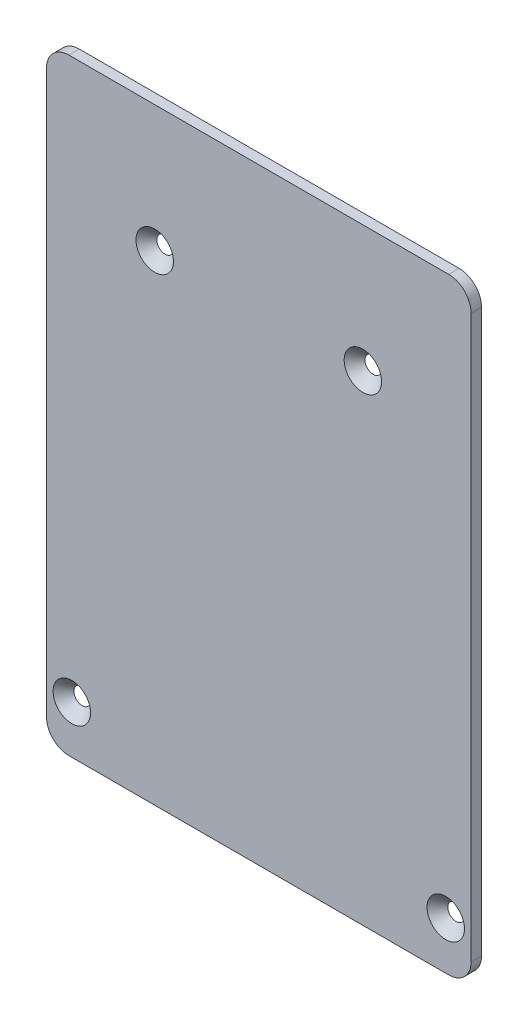
ISO-10303-21;
HEADER;
FILE_DESCRIPTION(('STEP AP214'),'2;1');
FILE_NAME('part.step','',(''),(''),'','','');
FILE_SCHEMA(('AUTOMOTIVE_DESIGN { 1 0 10303 214 1 1 1 1 }'));
ENDSEC;
DATA;
#1=APPLICATION_CONTEXT('core data for automotive mechanical design processes');
#2=APPLICATION_PROTOCOL_DEFINITION('international standard','automotive_design',2000,#1);
#3=PRODUCT_CONTEXT('',#1,'mechanical');
#4=PRODUCT('Part','Part','',(#3));
#5=PRODUCT_RELATED_PRODUCT_CATEGORY('part','',(#4));
#6=PRODUCT_DEFINITION_FORMATION('','',#4);
#7=PRODUCT_DEFINITION_CONTEXT('part definition',#1,'design');
#8=PRODUCT_DEFINITION('design','',#6,#7);
#9=PRODUCT_DEFINITION_SHAPE('','',#8);
#10=(LENGTH_UNIT() NAMED_UNIT(*) SI_UNIT(.MILLI.,.METRE.));
#11=(NAMED_UNIT(*) PLANE_ANGLE_UNIT() SI_UNIT($,.RADIAN.));
#12=(NAMED_UNIT(*) SI_UNIT($,.STERADIAN.) SOLID_ANGLE_UNIT());
#13=UNCERTAINTY_MEASURE_WITH_UNIT(LENGTH_MEASURE(1.E-05),#10,'distance_accuracy_value','');
#14=(GEOMETRIC_REPRESENTATION_CONTEXT(3) GLOBAL_UNCERTAINTY_ASSIGNED_CONTEXT((#13)) GLOBAL_UNIT_ASSIGNED_CONTEXT((#10,
#11,#12)) REPRESENTATION_CONTEXT('',''));
#15=CARTESIAN_POINT('',(0.,0.,0.));
#16=DIRECTION('',(0.,0.,1.));
#17=DIRECTION('',(1.,0.,0.));
#18=AXIS2_PLACEMENT_3D('',#15,#16,#17);
#19=CARTESIAN_POINT('',(-36.5,-54.,-2.));
#20=DIRECTION('',(0.,0.,1.));
#21=DIRECTION('',(1.,0.,0.));
#22=AXIS2_PLACEMENT_3D('',#19,#20,#21);
#23=CYLINDRICAL_SURFACE('',#22,4.3);
#24=CARTESIAN_POINT('',(-36.5,-54.,0.));
#25=DIRECTION('',(0.,0.,1.));
#26=DIRECTION('',(1.,0.,0.));
#27=AXIS2_PLACEMENT_3D('',#24,#25,#26);
#28=CIRCLE('',#27,4.3);
#29=CARTESIAN_POINT('',(-40.8,-54.,0.));
#30=VERTEX_POINT('',#29);
#31=CARTESIAN_POINT('',(-36.5,-58.3,0.));
#32=VERTEX_POINT('',#31);
#33=EDGE_CURVE('E260',#30,#32,#28,.T.);
#34=ORIENTED_EDGE('',*,*,#33,.F.);
#35=DIRECTION('',(0.,0.,1.));
#36=VECTOR('',#35,1.);
#37=CARTESIAN_POINT('',(-40.8,-54.,-2.));
#38=LINE('',#37,#36);
#39=CARTESIAN_POINT('',(-40.8,-54.,-2.));
#40=VERTEX_POINT('',#39);
#41=EDGE_CURVE('E172',#40,#30,#38,.T.);
#42=ORIENTED_EDGE('',*,*,#41,.F.);
#43=CARTESIAN_POINT('',(-36.5,-54.,-2.));
#44=DIRECTION('',(0.,0.,1.));
#45=DIRECTION('',(1.,0.,0.));
#46=AXIS2_PLACEMENT_3D('',#43,#44,#45);
#47=CIRCLE('',#46,4.3);
#48=CARTESIAN_POINT('',(-36.5,-58.3,-2.));
#49=VERTEX_POINT('',#48);
#50=EDGE_CURVE('E290',#40,#49,#47,.T.);
#51=ORIENTED_EDGE('',*,*,#50,.T.);
#52=DIRECTION('',(0.,0.,1.));
#53=VECTOR('',#52,1.);
#54=CARTESIAN_POINT('',(-36.5,-58.3,-2.));
#55=LINE('',#54,#53);
#56=EDGE_CURVE('E213',#49,#32,#55,.T.);
#57=ORIENTED_EDGE('',*,*,#56,.T.);
#58=EDGE_LOOP('',(#34,#42,#51,#57));
#59=FACE_BOUND('',#58,.T.);
#60=ADVANCED_FACE('F153',(#59),#23,.T.);
#61=CARTESIAN_POINT('',(-40.8,54.,-2.));
#62=DIRECTION('',(-1.,0.,0.));
#63=DIRECTION('',(0.,0.,1.));
#64=AXIS2_PLACEMENT_3D('',#61,#62,#63);
#65=PLANE('',#64);
#66=DIRECTION('',(0.,-1.,0.));
#67=VECTOR('',#66,1.);
#68=CARTESIAN_POINT('',(-40.8,54.,0.));
#69=LINE('',#68,#67);
#70=CARTESIAN_POINT('',(-40.8,54.,0.));
#71=VERTEX_POINT('',#70);
#72=EDGE_CURVE('E286',#71,#30,#69,.T.);
#73=ORIENTED_EDGE('',*,*,#72,.F.);
#74=DIRECTION('',(0.,0.,1.));
#75=VECTOR('',#74,1.);
#76=CARTESIAN_POINT('',(-40.8,54.,-2.));
#77=LINE('',#76,#75);
#78=CARTESIAN_POINT('',(-40.8,54.,-2.));
#79=VERTEX_POINT('',#78);
#80=EDGE_CURVE('E201',#79,#71,#77,.T.);
#81=ORIENTED_EDGE('',*,*,#80,.F.);
#82=DIRECTION('',(0.,-1.,0.));
#83=VECTOR('',#82,1.);
#84=CARTESIAN_POINT('',(-40.8,54.,-2.));
#85=LINE('',#84,#83);
#86=EDGE_CURVE('E246',#79,#40,#85,.T.);
#87=ORIENTED_EDGE('',*,*,#86,.T.);
#88=ORIENTED_EDGE('',*,*,#41,.T.);
#89=EDGE_LOOP('',(#73,#81,#87,#88));
#90=FACE_BOUND('',#89,.T.);
#91=ADVANCED_FACE('F361',(#90),#65,.T.);
#92=CARTESIAN_POINT('',(-36.5,54.,-2.));
#93=DIRECTION('',(0.,0.,1.));
#94=DIRECTION('',(1.,0.,0.));
#95=AXIS2_PLACEMENT_3D('',#92,#93,#94);
#96=CYLINDRICAL_SURFACE('',#95,4.29999999999999);
#97=CARTESIAN_POINT('',(-36.5,54.,0.));
#98=DIRECTION('',(0.,0.,1.));
#99=DIRECTION('',(1.,0.,0.));
#100=AXIS2_PLACEMENT_3D('',#97,#98,#99);
#101=CIRCLE('',#100,4.29999999999999);
#102=CARTESIAN_POINT('',(-36.5,58.3,0.));
#103=VERTEX_POINT('',#102);
#104=EDGE_CURVE('E232',#103,#71,#101,.T.);
#105=ORIENTED_EDGE('',*,*,#104,.F.);
#106=DIRECTION('',(0.,0.,1.));
#107=VECTOR('',#106,1.);
#108=CARTESIAN_POINT('',(-36.5,58.3,-2.));
#109=LINE('',#108,#107);
#110=CARTESIAN_POINT('',(-36.5,58.3,-2.));
#111=VERTEX_POINT('',#110);
#112=EDGE_CURVE('E227',#111,#103,#109,.T.);
#113=ORIENTED_EDGE('',*,*,#112,.F.);
#114=CARTESIAN_POINT('',(-36.5,54.,-2.));
#115=DIRECTION('',(0.,0.,1.));
#116=DIRECTION('',(1.,0.,0.));
#117=AXIS2_PLACEMENT_3D('',#114,#115,#116);
#118=CIRCLE('',#117,4.29999999999999);
#119=EDGE_CURVE('E230',#111,#79,#118,.T.);
#120=ORIENTED_EDGE('',*,*,#119,.T.);
#121=ORIENTED_EDGE('',*,*,#80,.T.);
#122=EDGE_LOOP('',(#105,#113,#120,#121));
#123=FACE_BOUND('',#122,.T.);
#124=ADVANCED_FACE('F229',(#123),#96,.T.);
#125=CARTESIAN_POINT('',(36.5,58.3,-2.));
#126=DIRECTION('',(0.,1.,0.));
#127=DIRECTION('',(0.,0.,1.));
#128=AXIS2_PLACEMENT_3D('',#125,#126,#127);
#129=PLANE('',#128);
#130=DIRECTION('',(-1.,0.,0.));
#131=VECTOR('',#130,1.);
#132=CARTESIAN_POINT('',(36.5,58.3,0.));
#133=LINE('',#132,#131);
#134=CARTESIAN_POINT('',(36.5,58.3,0.));
#135=VERTEX_POINT('',#134);
#136=EDGE_CURVE('E281',#135,#103,#133,.T.);
#137=ORIENTED_EDGE('',*,*,#136,.F.);
#138=DIRECTION('',(0.,0.,1.));
#139=VECTOR('',#138,1.);
#140=CARTESIAN_POINT('',(36.5,58.3,-2.));
#141=LINE('',#140,#139);
#142=CARTESIAN_POINT('',(36.5,58.3,-2.));
#143=VERTEX_POINT('',#142);
#144=EDGE_CURVE('E238',#143,#135,#141,.T.);
#145=ORIENTED_EDGE('',*,*,#144,.F.);
#146=DIRECTION('',(-1.,0.,0.));
#147=VECTOR('',#146,1.);
#148=CARTESIAN_POINT('',(36.5,58.3,-2.));
#149=LINE('',#148,#147);
#150=EDGE_CURVE('E244',#143,#111,#149,.T.);
#151=ORIENTED_EDGE('',*,*,#150,.T.);
#152=ORIENTED_EDGE('',*,*,#112,.T.);
#153=EDGE_LOOP('',(#137,#145,#151,#152));
#154=FACE_BOUND('',#153,.T.);
#155=ADVANCED_FACE('F249',(#154),#129,.T.);
#156=CARTESIAN_POINT('',(36.5,54.,-2.));
#157=DIRECTION('',(0.,0.,1.));
#158=DIRECTION('',(1.,0.,0.));
#159=AXIS2_PLACEMENT_3D('',#156,#157,#158);
#160=CYLINDRICAL_SURFACE('',#159,4.3);
#161=CARTESIAN_POINT('',(36.5,54.,0.));
#162=DIRECTION('',(0.,0.,1.));
#163=DIRECTION('',(1.,0.,0.));
#164=AXIS2_PLACEMENT_3D('',#161,#162,#163);
#165=CIRCLE('',#164,4.3);
#166=CARTESIAN_POINT('',(40.8,54.,0.));
#167=VERTEX_POINT('',#166);
#168=EDGE_CURVE('E277',#167,#135,#165,.T.);
#169=ORIENTED_EDGE('',*,*,#168,.F.);
#170=DIRECTION('',(0.,0.,1.));
#171=VECTOR('',#170,1.);
#172=CARTESIAN_POINT('',(40.8,54.,-2.));
#173=LINE('',#172,#171);
#174=CARTESIAN_POINT('',(40.8,54.,-2.));
#175=VERTEX_POINT('',#174);
#176=EDGE_CURVE('E298',#175,#167,#173,.T.);
#177=ORIENTED_EDGE('',*,*,#176,.F.);
#178=CARTESIAN_POINT('',(36.5,54.,-2.));
#179=DIRECTION('',(0.,0.,1.));
#180=DIRECTION('',(1.,0.,0.));
#181=AXIS2_PLACEMENT_3D('',#178,#179,#180);
#182=CIRCLE('',#181,4.3);
#183=EDGE_CURVE('E251',#175,#143,#182,.T.);
#184=ORIENTED_EDGE('',*,*,#183,.T.);
#185=ORIENTED_EDGE('',*,*,#144,.T.);
#186=EDGE_LOOP('',(#169,#177,#184,#185));
#187=FACE_BOUND('',#186,.T.);
#188=ADVANCED_FACE('F375',(#187),#160,.T.);
#189=CARTESIAN_POINT('',(40.8,-54.,-2.));
#190=DIRECTION('',(1.,0.,0.));
#191=DIRECTION('',(0.,0.,-1.));
#192=AXIS2_PLACEMENT_3D('',#189,#190,#191);
#193=PLANE('',#192);
#194=DIRECTION('',(0.,1.,0.));
#195=VECTOR('',#194,1.);
#196=CARTESIAN_POINT('',(40.8,-54.,0.));
#197=LINE('',#196,#195);
#198=CARTESIAN_POINT('',(40.8,-54.,0.));
#199=VERTEX_POINT('',#198);
#200=EDGE_CURVE('E273',#199,#167,#197,.T.);
#201=ORIENTED_EDGE('',*,*,#200,.F.);
#202=DIRECTION('',(0.,0.,1.));
#203=VECTOR('',#202,1.);
#204=CARTESIAN_POINT('',(40.8,-54.,-2.));
#205=LINE('',#204,#203);
#206=CARTESIAN_POINT('',(40.8,-54.,-2.));
#207=VERTEX_POINT('',#206);
#208=EDGE_CURVE('E301',#207,#199,#205,.T.);
#209=ORIENTED_EDGE('',*,*,#208,.F.);
#210=DIRECTION('',(0.,1.,0.));
#211=VECTOR('',#210,1.);
#212=CARTESIAN_POINT('',(40.8,-54.,-2.));
#213=LINE('',#212,#211);
#214=EDGE_CURVE('E254',#207,#175,#213,.T.);
#215=ORIENTED_EDGE('',*,*,#214,.T.);
#216=ORIENTED_EDGE('',*,*,#176,.T.);
#217=EDGE_LOOP('',(#201,#209,#215,#216));
#218=FACE_BOUND('',#217,.T.);
#219=ADVANCED_FACE('F353',(#218),#193,.T.);
#220=CARTESIAN_POINT('',(36.5,-54.,-2.));
#221=DIRECTION('',(0.,0.,1.));
#222=DIRECTION('',(1.,0.,0.));
#223=AXIS2_PLACEMENT_3D('',#220,#221,#222);
#224=CYLINDRICAL_SURFACE('',#223,4.3);
#225=CARTESIAN_POINT('',(36.5,-54.,0.));
#226=DIRECTION('',(0.,0.,1.));
#227=DIRECTION('',(1.,0.,0.));
#228=AXIS2_PLACEMENT_3D('',#225,#226,#227);
#229=CIRCLE('',#228,4.3);
#230=CARTESIAN_POINT('',(36.5,-58.3,0.));
#231=VERTEX_POINT('',#230);
#232=EDGE_CURVE('E269',#231,#199,#229,.T.);
#233=ORIENTED_EDGE('',*,*,#232,.F.);
#234=DIRECTION('',(0.,0.,1.));
#235=VECTOR('',#234,1.);
#236=CARTESIAN_POINT('',(36.5,-58.3,-2.));
#237=LINE('',#236,#235);
#238=CARTESIAN_POINT('',(36.5,-58.3,-2.));
#239=VERTEX_POINT('',#238);
#240=EDGE_CURVE('E304',#239,#231,#237,.T.);
#241=ORIENTED_EDGE('',*,*,#240,.F.);
#242=CARTESIAN_POINT('',(36.5,-54.,-2.));
#243=DIRECTION('',(0.,0.,1.));
#244=DIRECTION('',(1.,0.,0.));
#245=AXIS2_PLACEMENT_3D('',#242,#243,#244);
#246=CIRCLE('',#245,4.3);
#247=EDGE_CURVE('E345',#239,#207,#246,.T.);
#248=ORIENTED_EDGE('',*,*,#247,.T.);
#249=ORIENTED_EDGE('',*,*,#208,.T.);
#250=EDGE_LOOP('',(#233,#241,#248,#249));
#251=FACE_BOUND('',#250,.T.);
#252=ADVANCED_FACE('F358',(#251),#224,.T.);
#253=CARTESIAN_POINT('',(-36.5,-58.3,-2.));
#254=DIRECTION('',(0.,-1.,0.));
#255=DIRECTION('',(0.,0.,-1.));
#256=AXIS2_PLACEMENT_3D('',#253,#254,#255);
#257=PLANE('',#256);
#258=DIRECTION('',(1.,0.,0.));
#259=VECTOR('',#258,1.);
#260=CARTESIAN_POINT('',(-36.5,-58.3,0.));
#261=LINE('',#260,#259);
#262=EDGE_CURVE('E264',#32,#231,#261,.T.);
#263=ORIENTED_EDGE('',*,*,#262,.F.);
#264=ORIENTED_EDGE('',*,*,#56,.F.);
#265=DIRECTION('',(1.,0.,0.));
#266=VECTOR('',#265,1.);
#267=CARTESIAN_POINT('',(-36.5,-58.3,-2.));
#268=LINE('',#267,#266);
#269=EDGE_CURVE('E342',#49,#239,#268,.T.);
#270=ORIENTED_EDGE('',*,*,#269,.T.);
#271=ORIENTED_EDGE('',*,*,#240,.T.);
#272=EDGE_LOOP('',(#263,#264,#270,#271));
#273=FACE_BOUND('',#272,.T.);
#274=ADVANCED_FACE('F359',(#273),#257,.T.);
#275=CARTESIAN_POINT('',(-36.5,-54.,-2.));
#276=DIRECTION('',(0.,0.,1.));
#277=DIRECTION('',(1.,0.,0.));
#278=AXIS2_PLACEMENT_3D('',#275,#276,#277);
#279=PLANE('',#278);
#280=CARTESIAN_POINT('',(20.,34.,-2.));
#281=DIRECTION('',(0.,0.,1.));
#282=DIRECTION('',(1.,0.,0.));
#283=AXIS2_PLACEMENT_3D('',#280,#281,#282);
#284=CIRCLE('',#283,1.6);
#285=CARTESIAN_POINT('',(21.6,34.,-2.));
#286=VERTEX_POINT('',#285);
#287=EDGE_CURVE('E408',#286,#286,#284,.T.);
#288=ORIENTED_EDGE('',*,*,#287,.T.);
#289=EDGE_LOOP('',(#288));
#290=FACE_BOUND('',#289,.T.);
#291=CARTESIAN_POINT('',(-20.,34.,-2.));
#292=DIRECTION('',(0.,0.,1.));
#293=DIRECTION('',(1.,0.,0.));
#294=AXIS2_PLACEMENT_3D('',#291,#292,#293);
#295=CIRCLE('',#294,1.6);
#296=CARTESIAN_POINT('',(-18.4,34.,-2.));
#297=VERTEX_POINT('',#296);
#298=EDGE_CURVE('E336',#297,#297,#295,.T.);
#299=ORIENTED_EDGE('',*,*,#298,.T.);
#300=EDGE_LOOP('',(#299));
#301=FACE_BOUND('',#300,.T.);
#302=CARTESIAN_POINT('',(-35.93,-49.1,-2.));
#303=DIRECTION('',(0.,0.,1.));
#304=DIRECTION('',(1.,0.,0.));
#305=AXIS2_PLACEMENT_3D('',#302,#303,#304);
#306=CIRCLE('',#305,1.6);
#307=CARTESIAN_POINT('',(-34.33,-49.1,-2.));
#308=VERTEX_POINT('',#307);
#309=EDGE_CURVE('E332',#308,#308,#306,.T.);
#310=ORIENTED_EDGE('',*,*,#309,.T.);
#311=EDGE_LOOP('',(#310));
#312=FACE_BOUND('',#311,.T.);
#313=CARTESIAN_POINT('',(35.93,-49.1,-2.));
#314=DIRECTION('',(0.,0.,1.));
#315=DIRECTION('',(1.,0.,0.));
#316=AXIS2_PLACEMENT_3D('',#313,#314,#315);
#317=CIRCLE('',#316,1.6);
#318=CARTESIAN_POINT('',(37.53,-49.1,-2.));
#319=VERTEX_POINT('',#318);
#320=EDGE_CURVE('E265',#319,#319,#317,.T.);
#321=ORIENTED_EDGE('',*,*,#320,.T.);
#322=EDGE_LOOP('',(#321));
#323=FACE_BOUND('',#322,.T.);
#324=ORIENTED_EDGE('',*,*,#50,.F.);
#325=ORIENTED_EDGE('',*,*,#86,.F.);
#326=ORIENTED_EDGE('',*,*,#119,.F.);
#327=ORIENTED_EDGE('',*,*,#150,.F.);
#328=ORIENTED_EDGE('',*,*,#183,.F.);
#329=ORIENTED_EDGE('',*,*,#214,.F.);
#330=ORIENTED_EDGE('',*,*,#247,.F.);
#331=ORIENTED_EDGE('',*,*,#269,.F.);
#332=EDGE_LOOP('',(#324,#325,#326,#327,#328,#329,#330,#331));
#333=FACE_BOUND('',#332,.T.);
#334=ADVANCED_FACE('F242',(#290,#301,#312,#323,#333),#279,.F.);
#335=CARTESIAN_POINT('',(-36.5,-54.,0.));
#336=DIRECTION('',(0.,0.,1.));
#337=DIRECTION('',(1.,0.,0.));
#338=AXIS2_PLACEMENT_3D('',#335,#336,#337);
#339=PLANE('',#338);
#340=CARTESIAN_POINT('',(-35.93,-49.1,0.));
#341=DIRECTION('',(0.,0.,1.));
#342=DIRECTION('',(1.,0.,0.));
#343=AXIS2_PLACEMENT_3D('',#340,#341,#342);
#344=CIRCLE('',#343,3.59999999999999);
#345=CARTESIAN_POINT('',(-32.33,-49.1,0.));
#346=VERTEX_POINT('',#345);
#347=EDGE_CURVE('E12',#346,#346,#344,.F.);
#348=ORIENTED_EDGE('',*,*,#347,.T.);
#349=EDGE_LOOP('',(#348));
#350=FACE_BOUND('',#349,.T.);
#351=CARTESIAN_POINT('',(35.93,-49.1,0.));
#352=DIRECTION('',(0.,0.,1.));
#353=DIRECTION('',(1.,0.,0.));
#354=AXIS2_PLACEMENT_3D('',#351,#352,#353);
#355=CIRCLE('',#354,3.59999999999999);
#356=CARTESIAN_POINT('',(39.53,-49.1,0.));
#357=VERTEX_POINT('',#356);
#358=EDGE_CURVE('E164',#357,#357,#355,.F.);
#359=ORIENTED_EDGE('',*,*,#358,.T.);
#360=EDGE_LOOP('',(#359));
#361=FACE_BOUND('',#360,.T.);
#362=CARTESIAN_POINT('',(-20.,34.,0.));
#363=DIRECTION('',(0.,0.,1.));
#364=DIRECTION('',(1.,0.,0.));
#365=AXIS2_PLACEMENT_3D('',#362,#363,#364);
#366=CIRCLE('',#365,3.59999999999999);
#367=CARTESIAN_POINT('',(-16.4,34.,0.));
#368=VERTEX_POINT('',#367);
#369=EDGE_CURVE('E312',#368,#368,#366,.F.);
#370=ORIENTED_EDGE('',*,*,#369,.T.);
#371=EDGE_LOOP('',(#370));
#372=FACE_BOUND('',#371,.T.);
#373=CARTESIAN_POINT('',(20.,34.,0.));
#374=DIRECTION('',(0.,0.,1.));
#375=DIRECTION('',(1.,0.,0.));
#376=AXIS2_PLACEMENT_3D('',#373,#374,#375);
#377=CIRCLE('',#376,3.59999999999999);
#378=CARTESIAN_POINT('',(23.6,34.,0.));
#379=VERTEX_POINT('',#378);
#380=EDGE_CURVE('E293',#379,#379,#377,.F.);
#381=ORIENTED_EDGE('',*,*,#380,.T.);
#382=EDGE_LOOP('',(#381));
#383=FACE_BOUND('',#382,.T.);
#384=ORIENTED_EDGE('',*,*,#33,.T.);
#385=ORIENTED_EDGE('',*,*,#262,.T.);
#386=ORIENTED_EDGE('',*,*,#232,.T.);
#387=ORIENTED_EDGE('',*,*,#200,.T.);
#388=ORIENTED_EDGE('',*,*,#168,.T.);
#389=ORIENTED_EDGE('',*,*,#136,.T.);
#390=ORIENTED_EDGE('',*,*,#104,.T.);
#391=ORIENTED_EDGE('',*,*,#72,.T.);
#392=EDGE_LOOP('',(#384,#385,#386,#387,#388,#389,#390,#391));
#393=FACE_BOUND('',#392,.T.);
#394=ADVANCED_FACE('F319',(#350,#361,#372,#383,#393),#339,.T.);
#395=CARTESIAN_POINT('',(-35.93,-49.1,-1.99999999999999));
#396=DIRECTION('',(0.,0.,1.));
#397=DIRECTION('',(1.,0.,0.));
#398=AXIS2_PLACEMENT_3D('',#395,#396,#397);
#399=CONICAL_SURFACE('',#398,1.6,0.78539816339745);
#400=ORIENTED_EDGE('',*,*,#347,.F.);
#401=EDGE_LOOP('',(#400));
#402=FACE_BOUND('',#401,.T.);
#403=ORIENTED_EDGE('',*,*,#309,.F.);
#404=EDGE_LOOP('',(#403));
#405=FACE_BOUND('',#404,.T.);
#406=ADVANCED_FACE('F326',(#402,#405),#399,.F.);
#407=CARTESIAN_POINT('',(35.93,-49.1,-1.99999999999999));
#408=DIRECTION('',(0.,0.,1.));
#409=DIRECTION('',(1.,0.,0.));
#410=AXIS2_PLACEMENT_3D('',#407,#408,#409);
#411=CONICAL_SURFACE('',#410,1.6,0.78539816339745);
#412=ORIENTED_EDGE('',*,*,#358,.F.);
#413=EDGE_LOOP('',(#412));
#414=FACE_BOUND('',#413,.T.);
#415=ORIENTED_EDGE('',*,*,#320,.F.);
#416=EDGE_LOOP('',(#415));
#417=FACE_BOUND('',#416,.T.);
#418=ADVANCED_FACE('F322',(#414,#417),#411,.F.);
#419=CARTESIAN_POINT('',(-20.,34.,-1.99999999999998));
#420=DIRECTION('',(0.,0.,1.));
#421=DIRECTION('',(1.,0.,0.));
#422=AXIS2_PLACEMENT_3D('',#419,#420,#421);
#423=CONICAL_SURFACE('',#422,1.6,0.78539816339745);
#424=ORIENTED_EDGE('',*,*,#369,.F.);
#425=EDGE_LOOP('',(#424));
#426=FACE_BOUND('',#425,.T.);
#427=ORIENTED_EDGE('',*,*,#298,.F.);
#428=EDGE_LOOP('',(#427));
#429=FACE_BOUND('',#428,.T.);
#430=ADVANCED_FACE('F325',(#426,#429),#423,.F.);
#431=CARTESIAN_POINT('',(20.,34.,-1.99999999999998));
#432=DIRECTION('',(0.,0.,1.));
#433=DIRECTION('',(1.,0.,0.));
#434=AXIS2_PLACEMENT_3D('',#431,#432,#433);
#435=CONICAL_SURFACE('',#434,1.6,0.78539816339745);
#436=ORIENTED_EDGE('',*,*,#380,.F.);
#437=EDGE_LOOP('',(#436));
#438=FACE_BOUND('',#437,.T.);
#439=ORIENTED_EDGE('',*,*,#287,.F.);
#440=EDGE_LOOP('',(#439));
#441=FACE_BOUND('',#440,.T.);
#442=ADVANCED_FACE('F156',(#438,#441),#435,.F.);
#443=CLOSED_SHELL('',(#60,#91,#124,#155,#188,#219,#252,#274,#334,#394,#406,#418,#430,#442));
#444=MANIFOLD_SOLID_BREP('B2',#443);
#445=ADVANCED_BREP_SHAPE_REPRESENTATION('',(#18,#444),#14);
#446=SHAPE_DEFINITION_REPRESENTATION(#9,#445);
ENDSEC;
END-ISO-10303-21;
